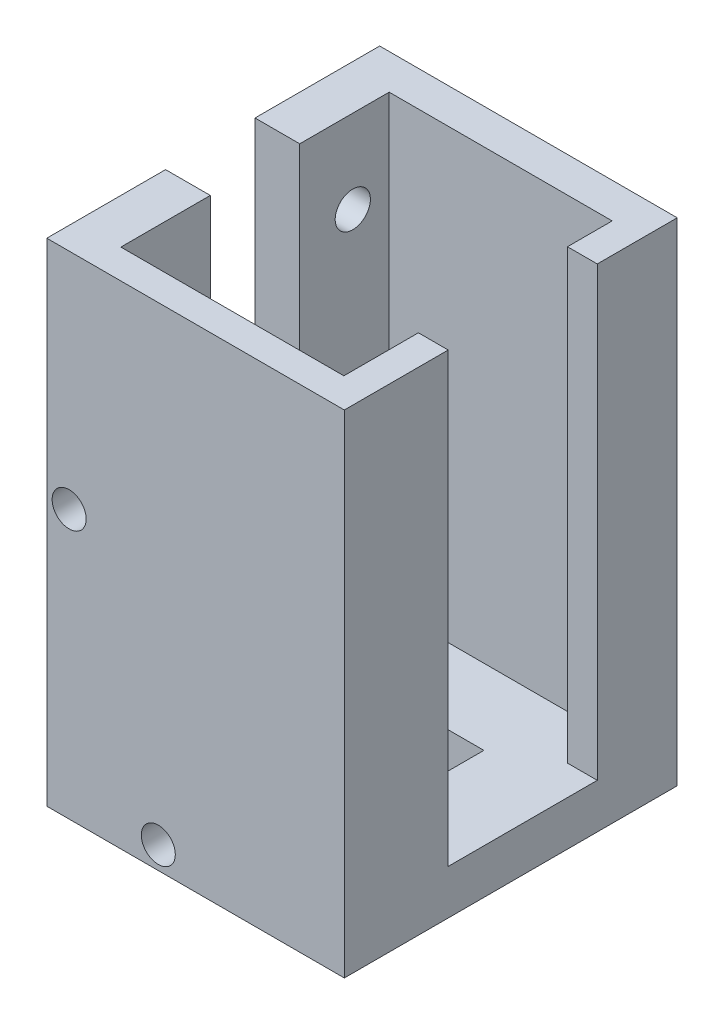
ISO-10303-21;
HEADER;
FILE_DESCRIPTION(('STEP AP214'),'2;1');
FILE_NAME('part.step','',(''),(''),'','','');
FILE_SCHEMA(('AUTOMOTIVE_DESIGN { 1 0 10303 214 1 1 1 1 }'));
ENDSEC;
DATA;
#1=APPLICATION_CONTEXT('core data for automotive mechanical design processes');
#2=APPLICATION_PROTOCOL_DEFINITION('international standard','automotive_design',2000,#1);
#3=PRODUCT_CONTEXT('',#1,'mechanical');
#4=PRODUCT('Part','Part','',(#3));
#5=PRODUCT_RELATED_PRODUCT_CATEGORY('part','',(#4));
#6=PRODUCT_DEFINITION_FORMATION('','',#4);
#7=PRODUCT_DEFINITION_CONTEXT('part definition',#1,'design');
#8=PRODUCT_DEFINITION('design','',#6,#7);
#9=PRODUCT_DEFINITION_SHAPE('','',#8);
#10=(LENGTH_UNIT() NAMED_UNIT(*) SI_UNIT(.MILLI.,.METRE.));
#11=(NAMED_UNIT(*) PLANE_ANGLE_UNIT() SI_UNIT($,.RADIAN.));
#12=(NAMED_UNIT(*) SI_UNIT($,.STERADIAN.) SOLID_ANGLE_UNIT());
#13=UNCERTAINTY_MEASURE_WITH_UNIT(LENGTH_MEASURE(1.E-05),#10,'distance_accuracy_value','');
#14=(GEOMETRIC_REPRESENTATION_CONTEXT(3) GLOBAL_UNCERTAINTY_ASSIGNED_CONTEXT((#13)) GLOBAL_UNIT_ASSIGNED_CONTEXT((#10,
#11,#12)) REPRESENTATION_CONTEXT('',''));
#15=CARTESIAN_POINT('',(0.,0.,0.));
#16=DIRECTION('',(0.,0.,1.));
#17=DIRECTION('',(1.,0.,0.));
#18=AXIS2_PLACEMENT_3D('',#15,#16,#17);
#19=CARTESIAN_POINT('',(-5.,-3.81,5.));
#20=DIRECTION('',(-1.,0.,0.));
#21=DIRECTION('',(0.,0.,1.));
#22=AXIS2_PLACEMENT_3D('',#19,#20,#21);
#23=PLANE('',#22);
#24=DIRECTION('',(0.,1.,0.));
#25=VECTOR('',#24,1.);
#26=CARTESIAN_POINT('',(-5.,-3.81,-5.));
#27=LINE('',#26,#25);
#28=CARTESIAN_POINT('',(-5.,-3.81,-5.));
#29=VERTEX_POINT('',#28);
#30=CARTESIAN_POINT('',(-5.,-2.7334926070883,-5.));
#31=VERTEX_POINT('',#30);
#32=EDGE_CURVE('E197',#29,#31,#27,.T.);
#33=ORIENTED_EDGE('',*,*,#32,.T.);
#34=DIRECTION('',(0.,0.,1.));
#35=VECTOR('',#34,1.);
#36=CARTESIAN_POINT('',(-5.,-2.7334926070883,-21.119219330882));
#37=LINE('',#36,#35);
#38=CARTESIAN_POINT('',(-5.,-2.7334926070883,5.));
#39=VERTEX_POINT('',#38);
#40=EDGE_CURVE('E187',#31,#39,#37,.T.);
#41=ORIENTED_EDGE('',*,*,#40,.T.);
#42=DIRECTION('',(0.,1.,0.));
#43=VECTOR('',#42,1.);
#44=CARTESIAN_POINT('',(-5.,-3.81,5.));
#45=LINE('',#44,#43);
#46=CARTESIAN_POINT('',(-5.,-3.81,5.));
#47=VERTEX_POINT('',#46);
#48=EDGE_CURVE('E195',#47,#39,#45,.T.);
#49=ORIENTED_EDGE('',*,*,#48,.F.);
#50=DIRECTION('',(0.,0.,1.));
#51=VECTOR('',#50,1.);
#52=CARTESIAN_POINT('',(-5.,-3.81,5.));
#53=LINE('',#52,#51);
#54=EDGE_CURVE('E367',#29,#47,#53,.T.);
#55=ORIENTED_EDGE('',*,*,#54,.F.);
#56=EDGE_LOOP('',(#33,#41,#49,#55));
#57=FACE_BOUND('',#56,.T.);
#58=ADVANCED_FACE('F40',(#57),#23,.F.);
#59=CARTESIAN_POINT('',(0.,38.1,0.));
#60=DIRECTION('',(0.,-1.,0.));
#61=DIRECTION('',(0.,0.,-1.));
#62=AXIS2_PLACEMENT_3D('',#59,#60,#61);
#63=PLANE('',#62);
#64=DIRECTION('',(0.,0.,-1.));
#65=VECTOR('',#64,1.);
#66=CARTESIAN_POINT('',(-9.5,38.1,-11.43));
#67=LINE('',#66,#65);
#68=CARTESIAN_POINT('',(-9.5,38.1,11.43));
#69=VERTEX_POINT('',#68);
#70=CARTESIAN_POINT('',(-9.5,38.1,3.81));
#71=VERTEX_POINT('',#70);
#72=EDGE_CURVE('E243',#69,#71,#67,.T.);
#73=ORIENTED_EDGE('',*,*,#72,.T.);
#74=DIRECTION('',(1.,0.,0.));
#75=VECTOR('',#74,1.);
#76=CARTESIAN_POINT('',(-13.31,38.1,3.81));
#77=LINE('',#76,#75);
#78=CARTESIAN_POINT('',(-13.31,38.1,3.81));
#79=VERTEX_POINT('',#78);
#80=EDGE_CURVE('E359',#79,#71,#77,.T.);
#81=ORIENTED_EDGE('',*,*,#80,.F.);
#82=DIRECTION('',(0.,0.,1.));
#83=VECTOR('',#82,1.);
#84=CARTESIAN_POINT('',(-13.31,38.1,13.93));
#85=LINE('',#84,#83);
#86=CARTESIAN_POINT('',(-13.31,38.1,13.93));
#87=VERTEX_POINT('',#86);
#88=EDGE_CURVE('E232',#79,#87,#85,.T.);
#89=ORIENTED_EDGE('',*,*,#88,.T.);
#90=DIRECTION('',(1.,0.,0.));
#91=VECTOR('',#90,1.);
#92=CARTESIAN_POINT('',(12.04,38.1,13.93));
#93=LINE('',#92,#91);
#94=CARTESIAN_POINT('',(12.04,38.1,13.93));
#95=VERTEX_POINT('',#94);
#96=EDGE_CURVE('E231',#87,#95,#93,.T.);
#97=ORIENTED_EDGE('',*,*,#96,.T.);
#98=DIRECTION('',(0.,0.,-1.));
#99=VECTOR('',#98,1.);
#100=CARTESIAN_POINT('',(12.04,38.1,13.93));
#101=LINE('',#100,#99);
#102=CARTESIAN_POINT('',(12.04,38.1,5.08));
#103=VERTEX_POINT('',#102);
#104=EDGE_CURVE('E234',#95,#103,#101,.T.);
#105=ORIENTED_EDGE('',*,*,#104,.T.);
#106=DIRECTION('',(-1.,0.,0.));
#107=VECTOR('',#106,1.);
#108=CARTESIAN_POINT('',(12.04,38.1,5.08));
#109=LINE('',#108,#107);
#110=CARTESIAN_POINT('',(9.5,38.1,5.08));
#111=VERTEX_POINT('',#110);
#112=EDGE_CURVE('E236',#103,#111,#109,.T.);
#113=ORIENTED_EDGE('',*,*,#112,.T.);
#114=DIRECTION('',(0.,0.,1.));
#115=VECTOR('',#114,1.);
#116=CARTESIAN_POINT('',(9.5,38.1,11.43));
#117=LINE('',#116,#115);
#118=CARTESIAN_POINT('',(9.5,38.1,11.43));
#119=VERTEX_POINT('',#118);
#120=EDGE_CURVE('E238',#111,#119,#117,.T.);
#121=ORIENTED_EDGE('',*,*,#120,.T.);
#122=DIRECTION('',(-1.,0.,0.));
#123=VECTOR('',#122,1.);
#124=CARTESIAN_POINT('',(-9.5,38.1,11.43));
#125=LINE('',#124,#123);
#126=EDGE_CURVE('E240',#119,#69,#125,.T.);
#127=ORIENTED_EDGE('',*,*,#126,.T.);
#128=EDGE_LOOP('',(#73,#81,#89,#97,#105,#113,#121,#127));
#129=FACE_BOUND('',#128,.T.);
#130=ADVANCED_FACE('F415',(#129),#63,.F.);
#131=CARTESIAN_POINT('',(-13.31,38.1,13.93));
#132=DIRECTION('',(1.,0.,0.));
#133=DIRECTION('',(0.,0.,-1.));
#134=AXIS2_PLACEMENT_3D('',#131,#132,#133);
#135=PLANE('',#134);
#136=CARTESIAN_POINT('',(-13.31,31.,9.1700096));
#137=DIRECTION('',(1.,0.,0.));
#138=DIRECTION('',(0.,0.,-1.));
#139=AXIS2_PLACEMENT_3D('',#136,#137,#138);
#140=CIRCLE('',#139,1.5);
#141=CARTESIAN_POINT('',(-13.31,31.,7.6700096));
#142=VERTEX_POINT('',#141);
#143=EDGE_CURVE('E331',#142,#142,#140,.T.);
#144=ORIENTED_EDGE('',*,*,#143,.T.);
#145=EDGE_LOOP('',(#144));
#146=FACE_BOUND('',#145,.T.);
#147=CARTESIAN_POINT('',(-13.31,31.,-8.3299904));
#148=DIRECTION('',(1.,0.,0.));
#149=DIRECTION('',(0.,0.,-1.));
#150=AXIS2_PLACEMENT_3D('',#147,#148,#149);
#151=CIRCLE('',#150,1.5);
#152=CARTESIAN_POINT('',(-13.31,31.,-9.8299904));
#153=VERTEX_POINT('',#152);
#154=EDGE_CURVE('E338',#153,#153,#151,.T.);
#155=ORIENTED_EDGE('',*,*,#154,.T.);
#156=EDGE_LOOP('',(#155));
#157=FACE_BOUND('',#156,.T.);
#158=ORIENTED_EDGE('',*,*,#88,.F.);
#159=DIRECTION('',(0.,-1.,0.));
#160=VECTOR('',#159,1.);
#161=CARTESIAN_POINT('',(-13.31,38.1,3.81));
#162=LINE('',#161,#160);
#163=CARTESIAN_POINT('',(-13.31,8.,3.80999999999999));
#164=VERTEX_POINT('',#163);
#165=EDGE_CURVE('E343',#79,#164,#162,.T.);
#166=ORIENTED_EDGE('',*,*,#165,.T.);
#167=DIRECTION('',(0.,0.,-1.));
#168=VECTOR('',#167,1.);
#169=CARTESIAN_POINT('',(-13.31,8.,3.80999999999999));
#170=LINE('',#169,#168);
#171=CARTESIAN_POINT('',(-13.31,8.,-3.81));
#172=VERTEX_POINT('',#171);
#173=EDGE_CURVE('E346',#164,#172,#170,.T.);
#174=ORIENTED_EDGE('',*,*,#173,.T.);
#175=DIRECTION('',(0.,1.,0.));
#176=VECTOR('',#175,1.);
#177=CARTESIAN_POINT('',(-13.31,38.1,-3.81));
#178=LINE('',#177,#176);
#179=CARTESIAN_POINT('',(-13.31,38.1,-3.81));
#180=VERTEX_POINT('',#179);
#181=EDGE_CURVE('E349',#172,#180,#178,.T.);
#182=ORIENTED_EDGE('',*,*,#181,.T.);
#183=CARTESIAN_POINT('',(-13.31,38.1,-14.43));
#184=VERTEX_POINT('',#183);
#185=EDGE_CURVE('E228',#184,#180,#85,.T.);
#186=ORIENTED_EDGE('',*,*,#185,.F.);
#187=DIRECTION('',(0.,-1.,0.));
#188=VECTOR('',#187,1.);
#189=CARTESIAN_POINT('',(-13.31,38.1,-14.43));
#190=LINE('',#189,#188);
#191=CARTESIAN_POINT('',(-13.31,-3.81,-14.43));
#192=VERTEX_POINT('',#191);
#193=EDGE_CURVE('E256',#184,#192,#190,.T.);
#194=ORIENTED_EDGE('',*,*,#193,.T.);
#195=DIRECTION('',(0.,0.,1.));
#196=VECTOR('',#195,1.);
#197=CARTESIAN_POINT('',(-13.31,-3.81,13.93));
#198=LINE('',#197,#196);
#199=CARTESIAN_POINT('',(-13.31,-3.81,13.93));
#200=VERTEX_POINT('',#199);
#201=EDGE_CURVE('E220',#192,#200,#198,.T.);
#202=ORIENTED_EDGE('',*,*,#201,.T.);
#203=DIRECTION('',(0.,-1.,0.));
#204=VECTOR('',#203,1.);
#205=CARTESIAN_POINT('',(-13.31,38.1,13.93));
#206=LINE('',#205,#204);
#207=EDGE_CURVE('E48',#87,#200,#206,.T.);
#208=ORIENTED_EDGE('',*,*,#207,.F.);
#209=EDGE_LOOP('',(#158,#166,#174,#182,#186,#194,#202,#208));
#210=FACE_BOUND('',#209,.T.);
#211=ADVANCED_FACE('F42',(#146,#157,#210),#135,.F.);
#212=CARTESIAN_POINT('',(12.04,38.1,13.93));
#213=DIRECTION('',(0.,0.,-1.));
#214=DIRECTION('',(-1.,0.,0.));
#215=AXIS2_PLACEMENT_3D('',#212,#213,#214);
#216=PLANE('',#215);
#217=CARTESIAN_POINT('',(-11.405,19.05,13.93));
#218=DIRECTION('',(0.,0.,1.));
#219=DIRECTION('',(1.,0.,0.));
#220=AXIS2_PLACEMENT_3D('',#217,#218,#219);
#221=CIRCLE('',#220,1.45);
#222=CARTESIAN_POINT('',(-9.955,19.05,13.93));
#223=VERTEX_POINT('',#222);
#224=EDGE_CURVE('E315',#223,#223,#221,.T.);
#225=ORIENTED_EDGE('',*,*,#224,.F.);
#226=EDGE_LOOP('',(#225));
#227=FACE_BOUND('',#226,.T.);
#228=CARTESIAN_POINT('',(-3.80999999999999,-1.905,13.93));
#229=DIRECTION('',(0.,0.,1.));
#230=DIRECTION('',(1.,0.,0.));
#231=AXIS2_PLACEMENT_3D('',#228,#229,#230);
#232=CIRCLE('',#231,1.45);
#233=CARTESIAN_POINT('',(-2.35999999999999,-1.905,13.93));
#234=VERTEX_POINT('',#233);
#235=EDGE_CURVE('E323',#234,#234,#232,.T.);
#236=ORIENTED_EDGE('',*,*,#235,.F.);
#237=EDGE_LOOP('',(#236));
#238=FACE_BOUND('',#237,.T.);
#239=ORIENTED_EDGE('',*,*,#207,.T.);
#240=DIRECTION('',(1.,0.,0.));
#241=VECTOR('',#240,1.);
#242=CARTESIAN_POINT('',(-13.31,-3.81,13.93));
#243=LINE('',#242,#241);
#244=CARTESIAN_POINT('',(12.04,-3.81,13.93));
#245=VERTEX_POINT('',#244);
#246=EDGE_CURVE('E223',#200,#245,#243,.T.);
#247=ORIENTED_EDGE('',*,*,#246,.T.);
#248=DIRECTION('',(0.,-1.,0.));
#249=VECTOR('',#248,1.);
#250=CARTESIAN_POINT('',(12.04,38.1,13.93));
#251=LINE('',#250,#249);
#252=EDGE_CURVE('E304',#95,#245,#251,.T.);
#253=ORIENTED_EDGE('',*,*,#252,.F.);
#254=ORIENTED_EDGE('',*,*,#96,.F.);
#255=EDGE_LOOP('',(#239,#247,#253,#254));
#256=FACE_BOUND('',#255,.T.);
#257=ADVANCED_FACE('F469',(#227,#238,#256),#216,.F.);
#258=CARTESIAN_POINT('',(12.04,38.1,5.08));
#259=DIRECTION('',(0.,0.,1.));
#260=DIRECTION('',(1.,0.,0.));
#261=AXIS2_PLACEMENT_3D('',#258,#259,#260);
#262=PLANE('',#261);
#263=DIRECTION('',(-1.,0.,0.));
#264=VECTOR('',#263,1.);
#265=CARTESIAN_POINT('',(12.04,0.,5.08));
#266=LINE('',#265,#264);
#267=CARTESIAN_POINT('',(12.04,0.,5.08));
#268=VERTEX_POINT('',#267);
#269=CARTESIAN_POINT('',(9.5,0.,5.08));
#270=VERTEX_POINT('',#269);
#271=EDGE_CURVE('E226',#268,#270,#266,.T.);
#272=ORIENTED_EDGE('',*,*,#271,.T.);
#273=DIRECTION('',(0.,-1.,0.));
#274=VECTOR('',#273,1.);
#275=CARTESIAN_POINT('',(9.5,38.1,5.08));
#276=LINE('',#275,#274);
#277=EDGE_CURVE('E298',#111,#270,#276,.T.);
#278=ORIENTED_EDGE('',*,*,#277,.F.);
#279=ORIENTED_EDGE('',*,*,#112,.F.);
#280=DIRECTION('',(0.,-1.,0.));
#281=VECTOR('',#280,1.);
#282=CARTESIAN_POINT('',(12.04,38.1,5.08));
#283=LINE('',#282,#281);
#284=EDGE_CURVE('E301',#103,#268,#283,.T.);
#285=ORIENTED_EDGE('',*,*,#284,.T.);
#286=EDGE_LOOP('',(#272,#278,#279,#285));
#287=FACE_BOUND('',#286,.T.);
#288=ADVANCED_FACE('F466',(#287),#262,.F.);
#289=CARTESIAN_POINT('',(9.5,38.1,11.43));
#290=DIRECTION('',(1.,0.,0.));
#291=DIRECTION('',(0.,0.,-1.));
#292=AXIS2_PLACEMENT_3D('',#289,#290,#291);
#293=PLANE('',#292);
#294=DIRECTION('',(0.,0.,1.));
#295=VECTOR('',#294,1.);
#296=CARTESIAN_POINT('',(9.5,0.,11.43));
#297=LINE('',#296,#295);
#298=CARTESIAN_POINT('',(9.5,0.,11.43));
#299=VERTEX_POINT('',#298);
#300=EDGE_CURVE('E259',#270,#299,#297,.T.);
#301=ORIENTED_EDGE('',*,*,#300,.T.);
#302=DIRECTION('',(0.,-1.,0.));
#303=VECTOR('',#302,1.);
#304=CARTESIAN_POINT('',(9.5,38.1,11.43));
#305=LINE('',#304,#303);
#306=EDGE_CURVE('E295',#119,#299,#305,.T.);
#307=ORIENTED_EDGE('',*,*,#306,.F.);
#308=ORIENTED_EDGE('',*,*,#120,.F.);
#309=ORIENTED_EDGE('',*,*,#277,.T.);
#310=EDGE_LOOP('',(#301,#307,#308,#309));
#311=FACE_BOUND('',#310,.T.);
#312=ADVANCED_FACE('F462',(#311),#293,.F.);
#313=CARTESIAN_POINT('',(-9.5,38.1,11.43));
#314=DIRECTION('',(0.,0.,1.));
#315=DIRECTION('',(1.,0.,0.));
#316=AXIS2_PLACEMENT_3D('',#313,#314,#315);
#317=PLANE('',#316);
#318=DIRECTION('',(-1.,0.,0.));
#319=VECTOR('',#318,1.);
#320=CARTESIAN_POINT('',(-9.5,0.,11.43));
#321=LINE('',#320,#319);
#322=CARTESIAN_POINT('',(-9.5,0.,11.43));
#323=VERTEX_POINT('',#322);
#324=EDGE_CURVE('E262',#299,#323,#321,.T.);
#325=ORIENTED_EDGE('',*,*,#324,.T.);
#326=DIRECTION('',(0.,-1.,0.));
#327=VECTOR('',#326,1.);
#328=CARTESIAN_POINT('',(-9.5,38.1,11.43));
#329=LINE('',#328,#327);
#330=EDGE_CURVE('E292',#69,#323,#329,.T.);
#331=ORIENTED_EDGE('',*,*,#330,.F.);
#332=ORIENTED_EDGE('',*,*,#126,.F.);
#333=ORIENTED_EDGE('',*,*,#306,.T.);
#334=EDGE_LOOP('',(#325,#331,#332,#333));
#335=FACE_BOUND('',#334,.T.);
#336=ADVANCED_FACE('F458',(#335),#317,.F.);
#337=CARTESIAN_POINT('',(-9.5,38.1,-11.43));
#338=DIRECTION('',(-1.,0.,0.));
#339=DIRECTION('',(0.,0.,1.));
#340=AXIS2_PLACEMENT_3D('',#337,#338,#339);
#341=PLANE('',#340);
#342=CARTESIAN_POINT('',(-9.5,31.,9.1700096));
#343=DIRECTION('',(1.,0.,0.));
#344=DIRECTION('',(0.,0.,-1.));
#345=AXIS2_PLACEMENT_3D('',#342,#343,#344);
#346=CIRCLE('',#345,1.5);
#347=CARTESIAN_POINT('',(-9.5,31.,7.6700096));
#348=VERTEX_POINT('',#347);
#349=EDGE_CURVE('E335',#348,#348,#346,.T.);
#350=ORIENTED_EDGE('',*,*,#349,.F.);
#351=EDGE_LOOP('',(#350));
#352=FACE_BOUND('',#351,.T.);
#353=CARTESIAN_POINT('',(-9.5,31.,-8.3299904));
#354=DIRECTION('',(1.,0.,0.));
#355=DIRECTION('',(0.,0.,-1.));
#356=AXIS2_PLACEMENT_3D('',#353,#354,#355);
#357=CIRCLE('',#356,1.5);
#358=CARTESIAN_POINT('',(-9.5,31.,-9.8299904));
#359=VERTEX_POINT('',#358);
#360=EDGE_CURVE('E330',#359,#359,#357,.T.);
#361=ORIENTED_EDGE('',*,*,#360,.F.);
#362=EDGE_LOOP('',(#361));
#363=FACE_BOUND('',#362,.T.);
#364=DIRECTION('',(0.,0.,-1.));
#365=VECTOR('',#364,1.);
#366=CARTESIAN_POINT('',(-9.5,8.,3.80999999999999));
#367=LINE('',#366,#365);
#368=CARTESIAN_POINT('',(-9.5,8.,3.80999999999999));
#369=VERTEX_POINT('',#368);
#370=CARTESIAN_POINT('',(-9.5,8.,-3.81000000000001));
#371=VERTEX_POINT('',#370);
#372=EDGE_CURVE('E355',#369,#371,#367,.T.);
#373=ORIENTED_EDGE('',*,*,#372,.F.);
#374=DIRECTION('',(0.,-1.,0.));
#375=VECTOR('',#374,1.);
#376=CARTESIAN_POINT('',(-9.5,38.1,3.81));
#377=LINE('',#376,#375);
#378=EDGE_CURVE('E334',#71,#369,#377,.T.);
#379=ORIENTED_EDGE('',*,*,#378,.F.);
#380=ORIENTED_EDGE('',*,*,#72,.F.);
#381=ORIENTED_EDGE('',*,*,#330,.T.);
#382=DIRECTION('',(0.,0.,-1.));
#383=VECTOR('',#382,1.);
#384=CARTESIAN_POINT('',(-9.5,0.,-11.43));
#385=LINE('',#384,#383);
#386=CARTESIAN_POINT('',(-9.5,0.,-11.43));
#387=VERTEX_POINT('',#386);
#388=EDGE_CURVE('E265',#323,#387,#385,.T.);
#389=ORIENTED_EDGE('',*,*,#388,.T.);
#390=DIRECTION('',(0.,-1.,0.));
#391=VECTOR('',#390,1.);
#392=CARTESIAN_POINT('',(-9.5,38.1,-11.43));
#393=LINE('',#392,#391);
#394=CARTESIAN_POINT('',(-9.5,38.1,-11.43));
#395=VERTEX_POINT('',#394);
#396=EDGE_CURVE('E289',#395,#387,#393,.T.);
#397=ORIENTED_EDGE('',*,*,#396,.F.);
#398=CARTESIAN_POINT('',(-9.5,38.1,-3.81000000000001));
#399=VERTEX_POINT('',#398);
#400=EDGE_CURVE('E242',#399,#395,#67,.T.);
#401=ORIENTED_EDGE('',*,*,#400,.F.);
#402=DIRECTION('',(0.,1.,0.));
#403=VECTOR('',#402,1.);
#404=CARTESIAN_POINT('',(-9.5,38.1,-3.81));
#405=LINE('',#404,#403);
#406=EDGE_CURVE('E62',#371,#399,#405,.T.);
#407=ORIENTED_EDGE('',*,*,#406,.F.);
#408=EDGE_LOOP('',(#373,#379,#380,#381,#389,#397,#401,#407));
#409=FACE_BOUND('',#408,.T.);
#410=ADVANCED_FACE('F454',(#352,#363,#409),#341,.F.);
#411=CARTESIAN_POINT('',(9.5,38.1,-11.43));
#412=DIRECTION('',(0.,0.,-1.));
#413=DIRECTION('',(-1.,0.,0.));
#414=AXIS2_PLACEMENT_3D('',#411,#412,#413);
#415=PLANE('',#414);
#416=DIRECTION('',(1.,0.,0.));
#417=VECTOR('',#416,1.);
#418=CARTESIAN_POINT('',(9.5,0.,-11.43));
#419=LINE('',#418,#417);
#420=CARTESIAN_POINT('',(9.5,0.,-11.43));
#421=VERTEX_POINT('',#420);
#422=EDGE_CURVE('E268',#387,#421,#419,.T.);
#423=ORIENTED_EDGE('',*,*,#422,.T.);
#424=DIRECTION('',(0.,-1.,0.));
#425=VECTOR('',#424,1.);
#426=CARTESIAN_POINT('',(9.5,38.1,-11.43));
#427=LINE('',#426,#425);
#428=CARTESIAN_POINT('',(9.5,38.1,-11.43));
#429=VERTEX_POINT('',#428);
#430=EDGE_CURVE('E286',#429,#421,#427,.T.);
#431=ORIENTED_EDGE('',*,*,#430,.F.);
#432=DIRECTION('',(1.,0.,0.));
#433=VECTOR('',#432,1.);
#434=CARTESIAN_POINT('',(9.5,38.1,-11.43));
#435=LINE('',#434,#433);
#436=EDGE_CURVE('E246',#395,#429,#435,.T.);
#437=ORIENTED_EDGE('',*,*,#436,.F.);
#438=ORIENTED_EDGE('',*,*,#396,.T.);
#439=EDGE_LOOP('',(#423,#431,#437,#438));
#440=FACE_BOUND('',#439,.T.);
#441=ADVANCED_FACE('F450',(#440),#415,.F.);
#442=CARTESIAN_POINT('',(9.50000000000001,38.1,-7.62));
#443=DIRECTION('',(1.,0.,0.));
#444=DIRECTION('',(0.,0.,-1.));
#445=AXIS2_PLACEMENT_3D('',#442,#443,#444);
#446=PLANE('',#445);
#447=DIRECTION('',(0.,0.,1.));
#448=VECTOR('',#447,1.);
#449=CARTESIAN_POINT('',(9.50000000000001,0.,-7.62));
#450=LINE('',#449,#448);
#451=CARTESIAN_POINT('',(9.50000000000001,0.,-7.62));
#452=VERTEX_POINT('',#451);
#453=EDGE_CURVE('E271',#421,#452,#450,.T.);
#454=ORIENTED_EDGE('',*,*,#453,.T.);
#455=DIRECTION('',(0.,-1.,0.));
#456=VECTOR('',#455,1.);
#457=CARTESIAN_POINT('',(9.50000000000001,38.1,-7.62));
#458=LINE('',#457,#456);
#459=CARTESIAN_POINT('',(9.50000000000001,38.1,-7.62));
#460=VERTEX_POINT('',#459);
#461=EDGE_CURVE('E283',#460,#452,#458,.T.);
#462=ORIENTED_EDGE('',*,*,#461,.F.);
#463=DIRECTION('',(0.,0.,1.));
#464=VECTOR('',#463,1.);
#465=CARTESIAN_POINT('',(9.50000000000001,38.1,-7.62));
#466=LINE('',#465,#464);
#467=EDGE_CURVE('E248',#429,#460,#466,.T.);
#468=ORIENTED_EDGE('',*,*,#467,.F.);
#469=ORIENTED_EDGE('',*,*,#430,.T.);
#470=EDGE_LOOP('',(#454,#462,#468,#469));
#471=FACE_BOUND('',#470,.T.);
#472=ADVANCED_FACE('F446',(#471),#446,.F.);
#473=CARTESIAN_POINT('',(12.04,38.1,-7.62));
#474=DIRECTION('',(0.,0.,-1.));
#475=DIRECTION('',(-1.,0.,0.));
#476=AXIS2_PLACEMENT_3D('',#473,#474,#475);
#477=PLANE('',#476);
#478=DIRECTION('',(1.,0.,0.));
#479=VECTOR('',#478,1.);
#480=CARTESIAN_POINT('',(12.04,0.,-7.62));
#481=LINE('',#480,#479);
#482=CARTESIAN_POINT('',(12.04,0.,-7.62));
#483=VERTEX_POINT('',#482);
#484=EDGE_CURVE('E274',#452,#483,#481,.T.);
#485=ORIENTED_EDGE('',*,*,#484,.T.);
#486=DIRECTION('',(0.,-1.,0.));
#487=VECTOR('',#486,1.);
#488=CARTESIAN_POINT('',(12.04,38.1,-7.62));
#489=LINE('',#488,#487);
#490=CARTESIAN_POINT('',(12.04,38.1,-7.62));
#491=VERTEX_POINT('',#490);
#492=EDGE_CURVE('E280',#491,#483,#489,.T.);
#493=ORIENTED_EDGE('',*,*,#492,.F.);
#494=DIRECTION('',(1.,0.,0.));
#495=VECTOR('',#494,1.);
#496=CARTESIAN_POINT('',(12.04,38.1,-7.62));
#497=LINE('',#496,#495);
#498=EDGE_CURVE('E250',#460,#491,#497,.T.);
#499=ORIENTED_EDGE('',*,*,#498,.F.);
#500=ORIENTED_EDGE('',*,*,#461,.T.);
#501=EDGE_LOOP('',(#485,#493,#499,#500));
#502=FACE_BOUND('',#501,.T.);
#503=ADVANCED_FACE('F442',(#502),#477,.F.);
#504=CARTESIAN_POINT('',(12.04,38.1,-14.43));
#505=DIRECTION('',(-1.,0.,0.));
#506=DIRECTION('',(0.,0.,1.));
#507=AXIS2_PLACEMENT_3D('',#504,#505,#506);
#508=PLANE('',#507);
#509=ORIENTED_EDGE('',*,*,#492,.T.);
#510=DIRECTION('',(0.,0.,-1.));
#511=VECTOR('',#510,1.);
#512=CARTESIAN_POINT('',(12.04,0.,13.93));
#513=LINE('',#512,#511);
#514=EDGE_CURVE('E217',#268,#483,#513,.T.);
#515=ORIENTED_EDGE('',*,*,#514,.F.);
#516=ORIENTED_EDGE('',*,*,#284,.F.);
#517=ORIENTED_EDGE('',*,*,#104,.F.);
#518=ORIENTED_EDGE('',*,*,#252,.T.);
#519=DIRECTION('',(0.,0.,-1.));
#520=VECTOR('',#519,1.);
#521=CARTESIAN_POINT('',(12.04,-3.81,13.93));
#522=LINE('',#521,#520);
#523=CARTESIAN_POINT('',(12.04,-3.81,-14.43));
#524=VERTEX_POINT('',#523);
#525=EDGE_CURVE('E213',#245,#524,#522,.T.);
#526=ORIENTED_EDGE('',*,*,#525,.T.);
#527=DIRECTION('',(0.,-1.,0.));
#528=VECTOR('',#527,1.);
#529=CARTESIAN_POINT('',(12.04,38.1,-14.43));
#530=LINE('',#529,#528);
#531=CARTESIAN_POINT('',(12.04,38.1,-14.43));
#532=VERTEX_POINT('',#531);
#533=EDGE_CURVE('E278',#532,#524,#530,.T.);
#534=ORIENTED_EDGE('',*,*,#533,.F.);
#535=DIRECTION('',(0.,0.,-1.));
#536=VECTOR('',#535,1.);
#537=CARTESIAN_POINT('',(12.04,38.1,-14.43));
#538=LINE('',#537,#536);
#539=EDGE_CURVE('E252',#491,#532,#538,.T.);
#540=ORIENTED_EDGE('',*,*,#539,.F.);
#541=EDGE_LOOP('',(#509,#515,#516,#517,#518,#526,#534,#540));
#542=FACE_BOUND('',#541,.T.);
#543=ADVANCED_FACE('F438',(#542),#508,.F.);
#544=CARTESIAN_POINT('',(-13.31,38.1,-14.43));
#545=DIRECTION('',(0.,0.,1.));
#546=DIRECTION('',(1.,0.,0.));
#547=AXIS2_PLACEMENT_3D('',#544,#545,#546);
#548=PLANE('',#547);
#549=ORIENTED_EDGE('',*,*,#533,.T.);
#550=DIRECTION('',(-1.,0.,0.));
#551=VECTOR('',#550,1.);
#552=CARTESIAN_POINT('',(-13.31,-3.81,-14.43));
#553=LINE('',#552,#551);
#554=EDGE_CURVE('E216',#524,#192,#553,.T.);
#555=ORIENTED_EDGE('',*,*,#554,.T.);
#556=ORIENTED_EDGE('',*,*,#193,.F.);
#557=DIRECTION('',(-1.,0.,0.));
#558=VECTOR('',#557,1.);
#559=CARTESIAN_POINT('',(-13.31,38.1,-14.43));
#560=LINE('',#559,#558);
#561=EDGE_CURVE('E254',#532,#184,#560,.T.);
#562=ORIENTED_EDGE('',*,*,#561,.F.);
#563=EDGE_LOOP('',(#549,#555,#556,#562));
#564=FACE_BOUND('',#563,.T.);
#565=ADVANCED_FACE('F434',(#564),#548,.F.);
#566=ORIENTED_EDGE('',*,*,#185,.T.);
#567=DIRECTION('',(1.,0.,0.));
#568=VECTOR('',#567,1.);
#569=CARTESIAN_POINT('',(-13.31,38.1,-3.81));
#570=LINE('',#569,#568);
#571=EDGE_CURVE('E362',#180,#399,#570,.T.);
#572=ORIENTED_EDGE('',*,*,#571,.T.);
#573=ORIENTED_EDGE('',*,*,#400,.T.);
#574=ORIENTED_EDGE('',*,*,#436,.T.);
#575=ORIENTED_EDGE('',*,*,#467,.T.);
#576=ORIENTED_EDGE('',*,*,#498,.T.);
#577=ORIENTED_EDGE('',*,*,#539,.T.);
#578=ORIENTED_EDGE('',*,*,#561,.T.);
#579=EDGE_LOOP('',(#566,#572,#573,#574,#575,#576,#577,#578));
#580=FACE_BOUND('',#579,.T.);
#581=ADVANCED_FACE('F422',(#580),#63,.F.);
#582=CARTESIAN_POINT('',(0.,-3.81,0.));
#583=DIRECTION('',(0.,-1.,0.));
#584=DIRECTION('',(0.,0.,-1.));
#585=AXIS2_PLACEMENT_3D('',#582,#583,#584);
#586=PLANE('',#585);
#587=ORIENTED_EDGE('',*,*,#54,.T.);
#588=DIRECTION('',(1.,0.,0.));
#589=VECTOR('',#588,1.);
#590=CARTESIAN_POINT('',(-5.,-3.81,5.));
#591=LINE('',#590,#589);
#592=CARTESIAN_POINT('',(5.,-3.81,5.));
#593=VERTEX_POINT('',#592);
#594=EDGE_CURVE('E203',#47,#593,#591,.T.);
#595=ORIENTED_EDGE('',*,*,#594,.T.);
#596=DIRECTION('',(0.,0.,-1.));
#597=VECTOR('',#596,1.);
#598=CARTESIAN_POINT('',(5.,-3.81,5.));
#599=LINE('',#598,#597);
#600=CARTESIAN_POINT('',(5.,-3.81,-5.));
#601=VERTEX_POINT('',#600);
#602=EDGE_CURVE('E371',#593,#601,#599,.T.);
#603=ORIENTED_EDGE('',*,*,#602,.T.);
#604=DIRECTION('',(-1.,0.,0.));
#605=VECTOR('',#604,1.);
#606=CARTESIAN_POINT('',(-5.,-3.81,-5.));
#607=LINE('',#606,#605);
#608=EDGE_CURVE('E210',#601,#29,#607,.T.);
#609=ORIENTED_EDGE('',*,*,#608,.T.);
#610=EDGE_LOOP('',(#587,#595,#603,#609));
#611=FACE_BOUND('',#610,.T.);
#612=ORIENTED_EDGE('',*,*,#525,.F.);
#613=ORIENTED_EDGE('',*,*,#246,.F.);
#614=ORIENTED_EDGE('',*,*,#201,.F.);
#615=ORIENTED_EDGE('',*,*,#554,.F.);
#616=EDGE_LOOP('',(#612,#613,#614,#615));
#617=FACE_BOUND('',#616,.T.);
#618=ADVANCED_FACE('F402',(#611,#617),#586,.T.);
#619=CARTESIAN_POINT('',(0.,0.,0.));
#620=DIRECTION('',(0.,-1.,0.));
#621=DIRECTION('',(0.,0.,-1.));
#622=AXIS2_PLACEMENT_3D('',#619,#620,#621);
#623=PLANE('',#622);
#624=DIRECTION('',(1.,0.,0.));
#625=VECTOR('',#624,1.);
#626=CARTESIAN_POINT('',(-5.,0.,5.));
#627=LINE('',#626,#625);
#628=CARTESIAN_POINT('',(-5.,0.,5.));
#629=VERTEX_POINT('',#628);
#630=CARTESIAN_POINT('',(5.,0.,5.));
#631=VERTEX_POINT('',#630);
#632=EDGE_CURVE('E378',#629,#631,#627,.T.);
#633=ORIENTED_EDGE('',*,*,#632,.F.);
#634=DIRECTION('',(0.,0.,1.));
#635=VECTOR('',#634,1.);
#636=CARTESIAN_POINT('',(-5.,0.,5.));
#637=LINE('',#636,#635);
#638=CARTESIAN_POINT('',(-5.,0.,-5.));
#639=VERTEX_POINT('',#638);
#640=EDGE_CURVE('E361',#639,#629,#637,.T.);
#641=ORIENTED_EDGE('',*,*,#640,.F.);
#642=DIRECTION('',(-1.,0.,0.));
#643=VECTOR('',#642,1.);
#644=CARTESIAN_POINT('',(-5.,0.,-5.));
#645=LINE('',#644,#643);
#646=CARTESIAN_POINT('',(5.,0.,-5.));
#647=VERTEX_POINT('',#646);
#648=EDGE_CURVE('E369',#647,#639,#645,.T.);
#649=ORIENTED_EDGE('',*,*,#648,.F.);
#650=DIRECTION('',(0.,0.,-1.));
#651=VECTOR('',#650,1.);
#652=CARTESIAN_POINT('',(5.,0.,5.));
#653=LINE('',#652,#651);
#654=EDGE_CURVE('E381',#631,#647,#653,.T.);
#655=ORIENTED_EDGE('',*,*,#654,.F.);
#656=EDGE_LOOP('',(#633,#641,#649,#655));
#657=FACE_BOUND('',#656,.T.);
#658=ORIENTED_EDGE('',*,*,#484,.F.);
#659=ORIENTED_EDGE('',*,*,#453,.F.);
#660=ORIENTED_EDGE('',*,*,#422,.F.);
#661=ORIENTED_EDGE('',*,*,#388,.F.);
#662=ORIENTED_EDGE('',*,*,#324,.F.);
#663=ORIENTED_EDGE('',*,*,#300,.F.);
#664=ORIENTED_EDGE('',*,*,#271,.F.);
#665=ORIENTED_EDGE('',*,*,#514,.T.);
#666=EDGE_LOOP('',(#658,#659,#660,#661,#662,#663,#664,#665));
#667=FACE_BOUND('',#666,.T.);
#668=ADVANCED_FACE('F398',(#657,#667),#623,.F.);
#669=CARTESIAN_POINT('',(-5.,-1.07650739291169,5.));
#670=VERTEX_POINT('',#669);
#671=EDGE_CURVE('E206',#670,#629,#45,.T.);
#672=ORIENTED_EDGE('',*,*,#671,.F.);
#673=DIRECTION('',(0.,0.,1.));
#674=VECTOR('',#673,1.);
#675=CARTESIAN_POINT('',(-5.,-1.0765073929117,-21.119219330882));
#676=LINE('',#675,#674);
#677=CARTESIAN_POINT('',(-5.,-1.0765073929117,-5.));
#678=VERTEX_POINT('',#677);
#679=EDGE_CURVE('E55',#670,#678,#676,.F.);
#680=ORIENTED_EDGE('',*,*,#679,.T.);
#681=EDGE_CURVE('E386',#678,#639,#27,.T.);
#682=ORIENTED_EDGE('',*,*,#681,.T.);
#683=ORIENTED_EDGE('',*,*,#640,.T.);
#684=EDGE_LOOP('',(#672,#680,#682,#683));
#685=FACE_BOUND('',#684,.T.);
#686=ADVANCED_FACE('F391',(#685),#23,.F.);
#687=CARTESIAN_POINT('',(-5.,-3.81,-5.));
#688=DIRECTION('',(0.,0.,-1.));
#689=DIRECTION('',(-1.,0.,0.));
#690=AXIS2_PLACEMENT_3D('',#687,#688,#689);
#691=PLANE('',#690);
#692=ORIENTED_EDGE('',*,*,#681,.F.);
#693=CARTESIAN_POINT('',(-3.80999999999999,-1.905,-5.));
#694=DIRECTION('',(0.,0.,-1.));
#695=DIRECTION('',(-1.,0.,0.));
#696=AXIS2_PLACEMENT_3D('',#693,#694,#695);
#697=CIRCLE('',#696,1.45);
#698=EDGE_CURVE('E198',#678,#31,#697,.T.);
#699=ORIENTED_EDGE('',*,*,#698,.T.);
#700=ORIENTED_EDGE('',*,*,#32,.F.);
#701=ORIENTED_EDGE('',*,*,#608,.F.);
#702=DIRECTION('',(0.,1.,0.));
#703=VECTOR('',#702,1.);
#704=CARTESIAN_POINT('',(5.,-3.81,-5.));
#705=LINE('',#704,#703);
#706=EDGE_CURVE('E208',#601,#647,#705,.T.);
#707=ORIENTED_EDGE('',*,*,#706,.T.);
#708=ORIENTED_EDGE('',*,*,#648,.T.);
#709=EDGE_LOOP('',(#692,#699,#700,#701,#707,#708));
#710=FACE_BOUND('',#709,.T.);
#711=ADVANCED_FACE('F395',(#710),#691,.F.);
#712=CARTESIAN_POINT('',(5.,-3.81,5.));
#713=DIRECTION('',(1.,0.,0.));
#714=DIRECTION('',(0.,0.,-1.));
#715=AXIS2_PLACEMENT_3D('',#712,#713,#714);
#716=PLANE('',#715);
#717=ORIENTED_EDGE('',*,*,#654,.T.);
#718=ORIENTED_EDGE('',*,*,#706,.F.);
#719=ORIENTED_EDGE('',*,*,#602,.F.);
#720=DIRECTION('',(0.,1.,0.));
#721=VECTOR('',#720,1.);
#722=CARTESIAN_POINT('',(5.,-3.81,5.));
#723=LINE('',#722,#721);
#724=EDGE_CURVE('E205',#593,#631,#723,.T.);
#725=ORIENTED_EDGE('',*,*,#724,.T.);
#726=EDGE_LOOP('',(#717,#718,#719,#725));
#727=FACE_BOUND('',#726,.T.);
#728=ADVANCED_FACE('F404',(#727),#716,.F.);
#729=CARTESIAN_POINT('',(-5.,-3.81,5.));
#730=DIRECTION('',(0.,0.,1.));
#731=DIRECTION('',(1.,0.,0.));
#732=AXIS2_PLACEMENT_3D('',#729,#730,#731);
#733=PLANE('',#732);
#734=ORIENTED_EDGE('',*,*,#48,.T.);
#735=CARTESIAN_POINT('',(-3.80999999999999,-1.905,5.));
#736=DIRECTION('',(0.,0.,1.));
#737=DIRECTION('',(1.,0.,0.));
#738=AXIS2_PLACEMENT_3D('',#735,#736,#737);
#739=CIRCLE('',#738,1.45);
#740=EDGE_CURVE('E13',#39,#670,#739,.T.);
#741=ORIENTED_EDGE('',*,*,#740,.T.);
#742=ORIENTED_EDGE('',*,*,#671,.T.);
#743=ORIENTED_EDGE('',*,*,#632,.T.);
#744=ORIENTED_EDGE('',*,*,#724,.F.);
#745=ORIENTED_EDGE('',*,*,#594,.F.);
#746=EDGE_LOOP('',(#734,#741,#742,#743,#744,#745));
#747=FACE_BOUND('',#746,.T.);
#748=ADVANCED_FACE('F200',(#747),#733,.F.);
#749=CARTESIAN_POINT('',(-13.31,38.1,3.81));
#750=DIRECTION('',(0.,0.,1.));
#751=DIRECTION('',(0.,-1.,0.));
#752=AXIS2_PLACEMENT_3D('',#749,#750,#751);
#753=PLANE('',#752);
#754=CARTESIAN_POINT('',(-11.405,19.05,3.80999999999999));
#755=DIRECTION('',(0.,0.,1.));
#756=DIRECTION('',(0.,-1.,0.));
#757=AXIS2_PLACEMENT_3D('',#754,#755,#756);
#758=CIRCLE('',#757,1.45);
#759=CARTESIAN_POINT('',(-11.405,17.6,3.80999999999999));
#760=VERTEX_POINT('',#759);
#761=EDGE_CURVE('E308',#760,#760,#758,.T.);
#762=ORIENTED_EDGE('',*,*,#761,.T.);
#763=EDGE_LOOP('',(#762));
#764=FACE_BOUND('',#763,.T.);
#765=ORIENTED_EDGE('',*,*,#378,.T.);
#766=DIRECTION('',(1.,0.,0.));
#767=VECTOR('',#766,1.);
#768=CARTESIAN_POINT('',(-13.31,8.,3.80999999999999));
#769=LINE('',#768,#767);
#770=EDGE_CURVE('E352',#164,#369,#769,.T.);
#771=ORIENTED_EDGE('',*,*,#770,.F.);
#772=ORIENTED_EDGE('',*,*,#165,.F.);
#773=ORIENTED_EDGE('',*,*,#80,.T.);
#774=EDGE_LOOP('',(#765,#771,#772,#773));
#775=FACE_BOUND('',#774,.T.);
#776=ADVANCED_FACE('F411',(#764,#775),#753,.F.);
#777=CARTESIAN_POINT('',(-13.31,38.1,-3.81));
#778=DIRECTION('',(0.,0.,-1.));
#779=DIRECTION('',(0.,1.,0.));
#780=AXIS2_PLACEMENT_3D('',#777,#778,#779);
#781=PLANE('',#780);
#782=CARTESIAN_POINT('',(-11.405,19.05,-3.81));
#783=DIRECTION('',(0.,0.,-1.));
#784=DIRECTION('',(0.,1.,0.));
#785=AXIS2_PLACEMENT_3D('',#782,#783,#784);
#786=CIRCLE('',#785,1.45);
#787=CARTESIAN_POINT('',(-11.405,20.5,-3.81));
#788=VERTEX_POINT('',#787);
#789=EDGE_CURVE('E306',#788,#788,#786,.T.);
#790=ORIENTED_EDGE('',*,*,#789,.T.);
#791=EDGE_LOOP('',(#790));
#792=FACE_BOUND('',#791,.T.);
#793=ORIENTED_EDGE('',*,*,#406,.T.);
#794=ORIENTED_EDGE('',*,*,#571,.F.);
#795=ORIENTED_EDGE('',*,*,#181,.F.);
#796=DIRECTION('',(1.,0.,0.));
#797=VECTOR('',#796,1.);
#798=CARTESIAN_POINT('',(-13.31,8.,-3.81));
#799=LINE('',#798,#797);
#800=EDGE_CURVE('E364',#172,#371,#799,.T.);
#801=ORIENTED_EDGE('',*,*,#800,.T.);
#802=EDGE_LOOP('',(#793,#794,#795,#801));
#803=FACE_BOUND('',#802,.T.);
#804=ADVANCED_FACE('F508',(#792,#803),#781,.F.);
#805=CARTESIAN_POINT('',(-13.31,8.,3.80999999999999));
#806=DIRECTION('',(0.,-1.,0.));
#807=DIRECTION('',(0.,0.,-1.));
#808=AXIS2_PLACEMENT_3D('',#805,#806,#807);
#809=PLANE('',#808);
#810=ORIENTED_EDGE('',*,*,#372,.T.);
#811=ORIENTED_EDGE('',*,*,#800,.F.);
#812=ORIENTED_EDGE('',*,*,#173,.F.);
#813=ORIENTED_EDGE('',*,*,#770,.T.);
#814=EDGE_LOOP('',(#810,#811,#812,#813));
#815=FACE_BOUND('',#814,.T.);
#816=ADVANCED_FACE('F506',(#815),#809,.F.);
#817=CARTESIAN_POINT('',(-13.31,31.,-8.3299904));
#818=DIRECTION('',(1.,0.,0.));
#819=DIRECTION('',(0.,0.,-1.));
#820=AXIS2_PLACEMENT_3D('',#817,#818,#819);
#821=CYLINDRICAL_SURFACE('',#820,1.5);
#822=ORIENTED_EDGE('',*,*,#154,.F.);
#823=EDGE_LOOP('',(#822));
#824=FACE_BOUND('',#823,.T.);
#825=ORIENTED_EDGE('',*,*,#360,.T.);
#826=EDGE_LOOP('',(#825));
#827=FACE_BOUND('',#826,.T.);
#828=ADVANCED_FACE('F529',(#824,#827),#821,.F.);
#829=CARTESIAN_POINT('',(-13.31,31.,9.1700096));
#830=DIRECTION('',(1.,0.,0.));
#831=DIRECTION('',(0.,0.,-1.));
#832=AXIS2_PLACEMENT_3D('',#829,#830,#831);
#833=CYLINDRICAL_SURFACE('',#832,1.5);
#834=ORIENTED_EDGE('',*,*,#143,.F.);
#835=EDGE_LOOP('',(#834));
#836=FACE_BOUND('',#835,.T.);
#837=ORIENTED_EDGE('',*,*,#349,.T.);
#838=EDGE_LOOP('',(#837));
#839=FACE_BOUND('',#838,.T.);
#840=ADVANCED_FACE('F536',(#836,#839),#833,.F.);
#841=CARTESIAN_POINT('',(-13.31,38.1,-10.414));
#842=DIRECTION('',(0.,0.,-1.));
#843=DIRECTION('',(0.,1.,0.));
#844=AXIS2_PLACEMENT_3D('',#841,#842,#843);
#845=PLANE('',#844);
#846=CARTESIAN_POINT('',(-11.405,19.05,-10.414));
#847=DIRECTION('',(0.,0.,-1.));
#848=DIRECTION('',(0.,1.,0.));
#849=AXIS2_PLACEMENT_3D('',#846,#847,#848);
#850=CIRCLE('',#849,1.45);
#851=CARTESIAN_POINT('',(-11.405,20.5,-10.414));
#852=VERTEX_POINT('',#851);
#853=EDGE_CURVE('E309',#852,#852,#850,.F.);
#854=ORIENTED_EDGE('',*,*,#853,.T.);
#855=EDGE_LOOP('',(#854));
#856=FACE_BOUND('',#855,.T.);
#857=ADVANCED_FACE('F540',(#856),#845,.F.);
#858=CARTESIAN_POINT('',(-11.405,19.05,-21.119219330882));
#859=DIRECTION('',(0.,0.,1.));
#860=DIRECTION('',(1.,0.,0.));
#861=AXIS2_PLACEMENT_3D('',#858,#859,#860);
#862=CYLINDRICAL_SURFACE('',#861,1.45);
#863=ORIENTED_EDGE('',*,*,#853,.F.);
#864=EDGE_LOOP('',(#863));
#865=FACE_BOUND('',#864,.T.);
#866=ORIENTED_EDGE('',*,*,#789,.F.);
#867=EDGE_LOOP('',(#866));
#868=FACE_BOUND('',#867,.T.);
#869=ADVANCED_FACE('F552',(#865,#868),#862,.F.);
#870=ORIENTED_EDGE('',*,*,#224,.T.);
#871=EDGE_LOOP('',(#870));
#872=FACE_BOUND('',#871,.T.);
#873=ORIENTED_EDGE('',*,*,#761,.F.);
#874=EDGE_LOOP('',(#873));
#875=FACE_BOUND('',#874,.T.);
#876=ADVANCED_FACE('F548',(#872,#875),#862,.F.);
#877=CARTESIAN_POINT('',(-3.80999999999999,-1.905,-21.119219330882));
#878=DIRECTION('',(0.,0.,1.));
#879=DIRECTION('',(1.,0.,0.));
#880=AXIS2_PLACEMENT_3D('',#877,#878,#879);
#881=CYLINDRICAL_SURFACE('',#880,1.45);
#882=ORIENTED_EDGE('',*,*,#235,.T.);
#883=EDGE_LOOP('',(#882));
#884=FACE_BOUND('',#883,.T.);
#885=CARTESIAN_POINT('',(-3.80999999999999,-1.905,-10.414));
#886=DIRECTION('',(0.,0.,-1.));
#887=DIRECTION('',(0.,1.,0.));
#888=AXIS2_PLACEMENT_3D('',#885,#886,#887);
#889=CIRCLE('',#888,1.45);
#890=CARTESIAN_POINT('',(-3.80999999999999,-0.454999999999997,-10.414));
#891=VERTEX_POINT('',#890);
#892=EDGE_CURVE('E320',#891,#891,#889,.F.);
#893=ORIENTED_EDGE('',*,*,#892,.F.);
#894=EDGE_LOOP('',(#893));
#895=FACE_BOUND('',#894,.T.);
#896=ORIENTED_EDGE('',*,*,#679,.F.);
#897=ORIENTED_EDGE('',*,*,#740,.F.);
#898=ORIENTED_EDGE('',*,*,#40,.F.);
#899=ORIENTED_EDGE('',*,*,#698,.F.);
#900=EDGE_LOOP('',(#896,#897,#898,#899));
#901=FACE_BOUND('',#900,.T.);
#902=ADVANCED_FACE('F186',(#884,#895,#901),#881,.F.);
#903=CARTESIAN_POINT('',(-13.31,38.1,-10.414));
#904=DIRECTION('',(0.,0.,-1.));
#905=DIRECTION('',(0.,1.,0.));
#906=AXIS2_PLACEMENT_3D('',#903,#904,#905);
#907=PLANE('',#906);
#908=ORIENTED_EDGE('',*,*,#892,.T.);
#909=EDGE_LOOP('',(#908));
#910=FACE_BOUND('',#909,.T.);
#911=ADVANCED_FACE('F542',(#910),#907,.F.);
#912=CLOSED_SHELL('',(#58,#130,#211,#257,#288,#312,#336,#410,#441,#472,#503,#543,#565,#581,#618,
#668,#686,#711,#728,#748,#776,#804,#816,#828,#840,#857,#869,#876,#902,#911));
#913=MANIFOLD_SOLID_BREP('B2',#912);
#914=ADVANCED_BREP_SHAPE_REPRESENTATION('',(#18,#913),#14);
#915=SHAPE_DEFINITION_REPRESENTATION(#9,#914);
ENDSEC;
END-ISO-10303-21;
